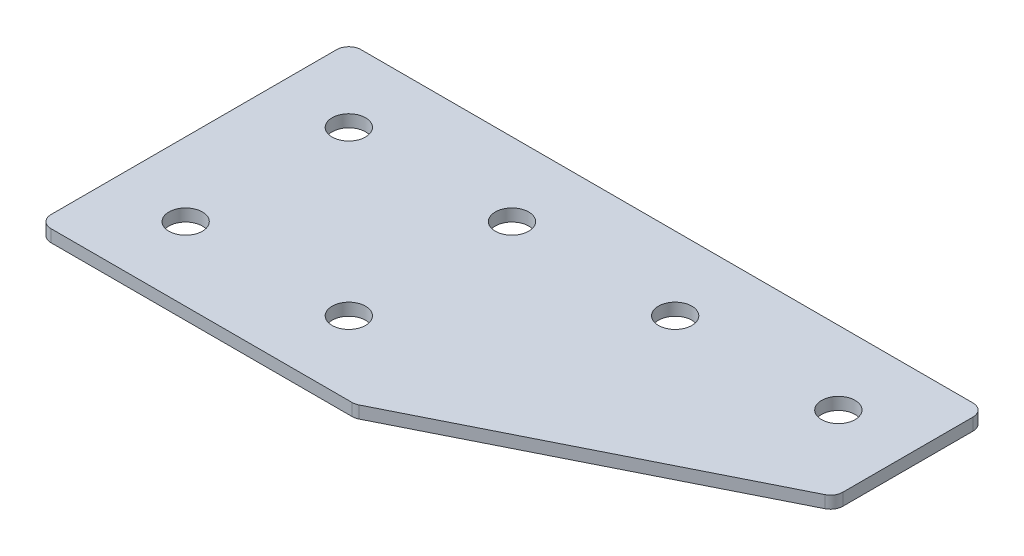
ISO-10303-21;
HEADER;
FILE_DESCRIPTION(('STEP AP214'),'2;1');
FILE_NAME('part.step','',(''),(''),'','','');
FILE_SCHEMA(('AUTOMOTIVE_DESIGN { 1 0 10303 214 1 1 1 1 }'));
ENDSEC;
DATA;
#1=APPLICATION_CONTEXT('core data for automotive mechanical design processes');
#2=APPLICATION_PROTOCOL_DEFINITION('international standard','automotive_design',2000,#1);
#3=PRODUCT_CONTEXT('',#1,'mechanical');
#4=PRODUCT('Part','Part','',(#3));
#5=PRODUCT_RELATED_PRODUCT_CATEGORY('part','',(#4));
#6=PRODUCT_DEFINITION_FORMATION('','',#4);
#7=PRODUCT_DEFINITION_CONTEXT('part definition',#1,'design');
#8=PRODUCT_DEFINITION('design','',#6,#7);
#9=PRODUCT_DEFINITION_SHAPE('','',#8);
#10=(LENGTH_UNIT() NAMED_UNIT(*) SI_UNIT(.MILLI.,.METRE.));
#11=(NAMED_UNIT(*) PLANE_ANGLE_UNIT() SI_UNIT($,.RADIAN.));
#12=(NAMED_UNIT(*) SI_UNIT($,.STERADIAN.) SOLID_ANGLE_UNIT());
#13=UNCERTAINTY_MEASURE_WITH_UNIT(LENGTH_MEASURE(1.E-05),#10,'distance_accuracy_value','');
#14=(GEOMETRIC_REPRESENTATION_CONTEXT(3) GLOBAL_UNCERTAINTY_ASSIGNED_CONTEXT((#13)) GLOBAL_UNIT_ASSIGNED_CONTEXT((#10,
#11,#12)) REPRESENTATION_CONTEXT('',''));
#15=CARTESIAN_POINT('',(0.,0.,0.));
#16=DIRECTION('',(0.,0.,1.));
#17=DIRECTION('',(1.,0.,0.));
#18=AXIS2_PLACEMENT_3D('',#15,#16,#17);
#19=CARTESIAN_POINT('',(-41.6411174198651,1.20798729371791,-21.0664297859648));
#20=DIRECTION('',(0.,-1.,0.));
#21=DIRECTION('',(0.,0.,-1.));
#22=AXIS2_PLACEMENT_3D('',#19,#20,#21);
#23=PLANE('',#22);
#24=CARTESIAN_POINT('',(-21.641117419865,1.20798729371791,18.9335702140352));
#25=DIRECTION('',(0.,1.,0.));
#26=DIRECTION('',(0.,0.,1.));
#27=AXIS2_PLACEMENT_3D('',#24,#25,#26);
#28=CIRCLE('',#27,4.1);
#29=CARTESIAN_POINT('',(-21.641117419865,1.20798729371791,23.0335702140352));
#30=VERTEX_POINT('',#29);
#31=EDGE_CURVE('E251',#30,#30,#28,.T.);
#32=ORIENTED_EDGE('',*,*,#31,.T.);
#33=EDGE_LOOP('',(#32));
#34=FACE_BOUND('',#33,.T.);
#35=CARTESIAN_POINT('',(-61.6411174198651,1.20798729371791,18.9335702140352));
#36=DIRECTION('',(0.,1.,0.));
#37=DIRECTION('',(0.,0.,1.));
#38=AXIS2_PLACEMENT_3D('',#35,#36,#37);
#39=CIRCLE('',#38,4.1);
#40=CARTESIAN_POINT('',(-61.6411174198651,1.20798729371791,23.0335702140352));
#41=VERTEX_POINT('',#40);
#42=EDGE_CURVE('E259',#41,#41,#39,.T.);
#43=ORIENTED_EDGE('',*,*,#42,.T.);
#44=EDGE_LOOP('',(#43));
#45=FACE_BOUND('',#44,.T.);
#46=CARTESIAN_POINT('',(58.358882580135,1.20798729371791,-21.0664297859648));
#47=DIRECTION('',(0.,1.,0.));
#48=DIRECTION('',(0.,0.,1.));
#49=AXIS2_PLACEMENT_3D('',#46,#47,#48);
#50=CIRCLE('',#49,4.09999999999999);
#51=CARTESIAN_POINT('',(58.358882580135,1.20798729371791,-16.9664297859648));
#52=VERTEX_POINT('',#51);
#53=EDGE_CURVE('E265',#52,#52,#50,.T.);
#54=ORIENTED_EDGE('',*,*,#53,.T.);
#55=EDGE_LOOP('',(#54));
#56=FACE_BOUND('',#55,.T.);
#57=CARTESIAN_POINT('',(18.358882580135,1.20798729371791,-21.0664297859648));
#58=DIRECTION('',(0.,1.,0.));
#59=DIRECTION('',(0.,0.,1.));
#60=AXIS2_PLACEMENT_3D('',#57,#58,#59);
#61=CIRCLE('',#60,4.09999999999999);
#62=CARTESIAN_POINT('',(18.358882580135,1.20798729371791,-16.9664297859648));
#63=VERTEX_POINT('',#62);
#64=EDGE_CURVE('E271',#63,#63,#61,.T.);
#65=ORIENTED_EDGE('',*,*,#64,.T.);
#66=EDGE_LOOP('',(#65));
#67=FACE_BOUND('',#66,.T.);
#68=CARTESIAN_POINT('',(-21.641117419865,1.20798729371791,-21.0664297859648));
#69=DIRECTION('',(0.,1.,0.));
#70=DIRECTION('',(0.,0.,1.));
#71=AXIS2_PLACEMENT_3D('',#68,#69,#70);
#72=CIRCLE('',#71,4.1);
#73=CARTESIAN_POINT('',(-21.641117419865,1.20798729371791,-16.9664297859648));
#74=VERTEX_POINT('',#73);
#75=EDGE_CURVE('E277',#74,#74,#72,.T.);
#76=ORIENTED_EDGE('',*,*,#75,.T.);
#77=EDGE_LOOP('',(#76));
#78=FACE_BOUND('',#77,.T.);
#79=CARTESIAN_POINT('',(-61.6411174198651,1.20798729371791,-21.0664297859648));
#80=DIRECTION('',(0.,1.,0.));
#81=DIRECTION('',(0.,0.,1.));
#82=AXIS2_PLACEMENT_3D('',#79,#80,#81);
#83=CIRCLE('',#82,4.1);
#84=CARTESIAN_POINT('',(-61.6411174198651,1.20798729371791,-16.9664297859648));
#85=VERTEX_POINT('',#84);
#86=EDGE_CURVE('E175',#85,#85,#83,.T.);
#87=ORIENTED_EDGE('',*,*,#86,.T.);
#88=EDGE_LOOP('',(#87));
#89=FACE_BOUND('',#88,.T.);
#90=DIRECTION('',(1.,0.,0.));
#91=VECTOR('',#90,1.);
#92=CARTESIAN_POINT('',(-79.6411174198652,1.20798729371791,36.9335702140352));
#93=LINE('',#92,#91);
#94=CARTESIAN_POINT('',(-76.6411174198652,1.20798729371791,36.9335702140352));
#95=VERTEX_POINT('',#94);
#96=CARTESIAN_POINT('',(-2.8214573073639,1.20798729371791,36.9335702140352));
#97=VERTEX_POINT('',#96);
#98=EDGE_CURVE('E121',#95,#97,#93,.T.);
#99=ORIENTED_EDGE('',*,*,#98,.F.);
#100=CARTESIAN_POINT('',(-76.6411174198652,1.20798729371791,33.9335702140352));
#101=DIRECTION('',(0.,-1.,0.));
#102=DIRECTION('',(0.,0.,-1.));
#103=AXIS2_PLACEMENT_3D('',#100,#101,#102);
#104=CIRCLE('',#103,3.);
#105=CARTESIAN_POINT('',(-79.6411174198652,1.20798729371791,33.9335702140352));
#106=VERTEX_POINT('',#105);
#107=EDGE_CURVE('E145',#95,#106,#104,.T.);
#108=ORIENTED_EDGE('',*,*,#107,.T.);
#109=DIRECTION('',(0.,0.,1.));
#110=VECTOR('',#109,1.);
#111=CARTESIAN_POINT('',(-79.6411174198652,1.20798729371791,-39.0664297859648));
#112=LINE('',#111,#110);
#113=CARTESIAN_POINT('',(-79.6411174198652,1.20798729371791,-36.0664297859648));
#114=VERTEX_POINT('',#113);
#115=EDGE_CURVE('E162',#114,#106,#112,.T.);
#116=ORIENTED_EDGE('',*,*,#115,.F.);
#117=CARTESIAN_POINT('',(-76.6411174198652,1.20798729371791,-36.0664297859648));
#118=DIRECTION('',(0.,-1.,0.));
#119=DIRECTION('',(0.,0.,-1.));
#120=AXIS2_PLACEMENT_3D('',#117,#118,#119);
#121=CIRCLE('',#120,3.);
#122=CARTESIAN_POINT('',(-76.6411174198652,1.20798729371791,-39.0664297859648));
#123=VERTEX_POINT('',#122);
#124=EDGE_CURVE('E117',#114,#123,#121,.T.);
#125=ORIENTED_EDGE('',*,*,#124,.T.);
#126=DIRECTION('',(-1.,0.,0.));
#127=VECTOR('',#126,1.);
#128=CARTESIAN_POINT('',(76.3588825801348,1.20798729371791,-39.0664297859648));
#129=LINE('',#128,#127);
#130=CARTESIAN_POINT('',(73.3588825801348,1.20798729371791,-39.0664297859648));
#131=VERTEX_POINT('',#130);
#132=EDGE_CURVE('E160',#131,#123,#129,.T.);
#133=ORIENTED_EDGE('',*,*,#132,.F.);
#134=CARTESIAN_POINT('',(73.3588825801348,1.20798729371791,-36.0664297859648));
#135=DIRECTION('',(0.,-1.,0.));
#136=DIRECTION('',(0.,0.,-1.));
#137=AXIS2_PLACEMENT_3D('',#134,#135,#136);
#138=CIRCLE('',#137,3.);
#139=CARTESIAN_POINT('',(76.3588825801348,1.20798729371791,-36.0664297859648));
#140=VERTEX_POINT('',#139);
#141=EDGE_CURVE('E140',#131,#140,#138,.T.);
#142=ORIENTED_EDGE('',*,*,#141,.T.);
#143=DIRECTION('',(0.,0.,-1.));
#144=VECTOR('',#143,1.);
#145=CARTESIAN_POINT('',(76.3588825801348,1.20798729371791,-2.3024977634646));
#146=LINE('',#145,#144);
#147=CARTESIAN_POINT('',(76.3588825801348,1.20798729371791,-4.15659972971429));
#148=VERTEX_POINT('',#147);
#149=EDGE_CURVE('E163',#148,#140,#146,.T.);
#150=ORIENTED_EDGE('',*,*,#149,.F.);
#151=CARTESIAN_POINT('',(73.3588825801348,1.20798729371791,-4.15659972971429));
#152=DIRECTION('',(0.,-1.,0.));
#153=DIRECTION('',(0.,0.,-1.));
#154=AXIS2_PLACEMENT_3D('',#151,#152,#153);
#155=CIRCLE('',#154,3.);
#156=CARTESIAN_POINT('',(74.7005233666347,1.20798729371791,-1.47331815671452));
#157=VERTEX_POINT('',#156);
#158=EDGE_CURVE('E31',#148,#157,#155,.T.);
#159=ORIENTED_EDGE('',*,*,#158,.T.);
#160=DIRECTION('',(0.894427190999915,0.,-0.447213595499959));
#161=VECTOR('',#160,1.);
#162=CARTESIAN_POINT('',(-2.11325337486452,1.20798729371791,36.9335702140352));
#163=LINE('',#162,#161);
#164=CARTESIAN_POINT('',(-1.47981652086402,1.20798729371791,36.6168517870349));
#165=VERTEX_POINT('',#164);
#166=EDGE_CURVE('E118',#165,#157,#163,.T.);
#167=ORIENTED_EDGE('',*,*,#166,.F.);
#168=CARTESIAN_POINT('',(-2.8214573073639,1.20798729371791,33.9335702140352));
#169=DIRECTION('',(0.,-1.,0.));
#170=DIRECTION('',(0.,0.,-1.));
#171=AXIS2_PLACEMENT_3D('',#168,#169,#170);
#172=CIRCLE('',#171,3.);
#173=EDGE_CURVE('E143',#165,#97,#172,.T.);
#174=ORIENTED_EDGE('',*,*,#173,.T.);
#175=EDGE_LOOP('',(#99,#108,#116,#125,#133,#142,#150,#159,#167,#174));
#176=FACE_BOUND('',#175,.T.);
#177=ADVANCED_FACE('F16',(#34,#45,#56,#67,#78,#89,#176),#23,.T.);
#178=CARTESIAN_POINT('',(76.3588825801348,1.20798729371791,-2.3024977634646));
#179=DIRECTION('',(1.,0.,0.));
#180=DIRECTION('',(0.,0.,-1.));
#181=AXIS2_PLACEMENT_3D('',#178,#179,#180);
#182=PLANE('',#181);
#183=DIRECTION('',(0.,0.,-1.));
#184=VECTOR('',#183,1.);
#185=CARTESIAN_POINT('',(76.3588825801348,4.20798729371791,-2.3024977634646));
#186=LINE('',#185,#184);
#187=CARTESIAN_POINT('',(76.3588825801348,4.20798729371791,-4.15659972971429));
#188=VERTEX_POINT('',#187);
#189=CARTESIAN_POINT('',(76.3588825801348,4.20798729371791,-36.0664297859648));
#190=VERTEX_POINT('',#189);
#191=EDGE_CURVE('E172',#188,#190,#186,.T.);
#192=ORIENTED_EDGE('',*,*,#191,.F.);
#193=DIRECTION('',(0.,1.,0.));
#194=VECTOR('',#193,1.);
#195=CARTESIAN_POINT('',(76.3588825801348,1.20798729371791,-4.15659972971429));
#196=LINE('',#195,#194);
#197=EDGE_CURVE('E154',#188,#148,#196,.F.);
#198=ORIENTED_EDGE('',*,*,#197,.T.);
#199=ORIENTED_EDGE('',*,*,#149,.T.);
#200=DIRECTION('',(0.,1.,0.));
#201=VECTOR('',#200,1.);
#202=CARTESIAN_POINT('',(76.3588825801348,1.20798729371791,-36.0664297859648));
#203=LINE('',#202,#201);
#204=EDGE_CURVE('E151',#140,#190,#203,.T.);
#205=ORIENTED_EDGE('',*,*,#204,.T.);
#206=EDGE_LOOP('',(#192,#198,#199,#205));
#207=FACE_BOUND('',#206,.T.);
#208=ADVANCED_FACE('F206',(#207),#182,.T.);
#209=CARTESIAN_POINT('',(-2.11325337486452,1.20798729371791,36.9335702140352));
#210=DIRECTION('',(0.447213595499959,0.,0.894427190999916));
#211=DIRECTION('',(0.894427190999916,0.,-0.447213595499959));
#212=AXIS2_PLACEMENT_3D('',#209,#210,#211);
#213=PLANE('',#212);
#214=DIRECTION('',(0.894427190999915,0.,-0.447213595499959));
#215=VECTOR('',#214,1.);
#216=CARTESIAN_POINT('',(-2.11325337486452,4.20798729371791,36.9335702140352));
#217=LINE('',#216,#215);
#218=CARTESIAN_POINT('',(-1.47981652086402,4.20798729371791,36.6168517870349));
#219=VERTEX_POINT('',#218);
#220=CARTESIAN_POINT('',(74.7005233666347,4.20798729371791,-1.47331815671452));
#221=VERTEX_POINT('',#220);
#222=EDGE_CURVE('E124',#219,#221,#217,.T.);
#223=ORIENTED_EDGE('',*,*,#222,.F.);
#224=DIRECTION('',(0.,1.,0.));
#225=VECTOR('',#224,1.);
#226=CARTESIAN_POINT('',(-1.47981652086402,1.20798729371791,36.6168517870349));
#227=LINE('',#226,#225);
#228=EDGE_CURVE('E38',#219,#165,#227,.F.);
#229=ORIENTED_EDGE('',*,*,#228,.T.);
#230=ORIENTED_EDGE('',*,*,#166,.T.);
#231=DIRECTION('',(0.,1.,0.));
#232=VECTOR('',#231,1.);
#233=CARTESIAN_POINT('',(74.7005233666347,1.20798729371791,-1.47331815671455));
#234=LINE('',#233,#232);
#235=EDGE_CURVE('E147',#157,#221,#234,.T.);
#236=ORIENTED_EDGE('',*,*,#235,.T.);
#237=EDGE_LOOP('',(#223,#229,#230,#236));
#238=FACE_BOUND('',#237,.T.);
#239=ADVANCED_FACE('F180',(#238),#213,.T.);
#240=CARTESIAN_POINT('',(-79.6411174198652,1.20798729371791,36.9335702140352));
#241=DIRECTION('',(0.,0.,1.));
#242=DIRECTION('',(1.,0.,0.));
#243=AXIS2_PLACEMENT_3D('',#240,#241,#242);
#244=PLANE('',#243);
#245=DIRECTION('',(1.,0.,0.));
#246=VECTOR('',#245,1.);
#247=CARTESIAN_POINT('',(-79.6411174198652,4.20798729371791,36.9335702140352));
#248=LINE('',#247,#246);
#249=CARTESIAN_POINT('',(-76.6411174198652,4.20798729371791,36.9335702140352));
#250=VERTEX_POINT('',#249);
#251=CARTESIAN_POINT('',(-2.8214573073639,4.20798729371791,36.9335702140352));
#252=VERTEX_POINT('',#251);
#253=EDGE_CURVE('E114',#250,#252,#248,.T.);
#254=ORIENTED_EDGE('',*,*,#253,.F.);
#255=DIRECTION('',(0.,1.,0.));
#256=VECTOR('',#255,1.);
#257=CARTESIAN_POINT('',(-76.6411174198652,1.20798729371791,36.9335702140352));
#258=LINE('',#257,#256);
#259=EDGE_CURVE('E137',#250,#95,#258,.F.);
#260=ORIENTED_EDGE('',*,*,#259,.T.);
#261=ORIENTED_EDGE('',*,*,#98,.T.);
#262=DIRECTION('',(0.,1.,0.));
#263=VECTOR('',#262,1.);
#264=CARTESIAN_POINT('',(-2.8214573073639,1.20798729371791,36.9335702140352));
#265=LINE('',#264,#263);
#266=EDGE_CURVE('E134',#97,#252,#265,.T.);
#267=ORIENTED_EDGE('',*,*,#266,.T.);
#268=EDGE_LOOP('',(#254,#260,#261,#267));
#269=FACE_BOUND('',#268,.T.);
#270=ADVANCED_FACE('F189',(#269),#244,.T.);
#271=CARTESIAN_POINT('',(-79.6411174198652,1.20798729371791,-39.0664297859648));
#272=DIRECTION('',(-1.,0.,0.));
#273=DIRECTION('',(0.,0.,1.));
#274=AXIS2_PLACEMENT_3D('',#271,#272,#273);
#275=PLANE('',#274);
#276=ORIENTED_EDGE('',*,*,#115,.T.);
#277=DIRECTION('',(0.,1.,0.));
#278=VECTOR('',#277,1.);
#279=CARTESIAN_POINT('',(-79.6411174198652,1.20798729371791,33.9335702140352));
#280=LINE('',#279,#278);
#281=CARTESIAN_POINT('',(-79.6411174198652,4.20798729371791,33.9335702140352));
#282=VERTEX_POINT('',#281);
#283=EDGE_CURVE('E105',#106,#282,#280,.T.);
#284=ORIENTED_EDGE('',*,*,#283,.T.);
#285=DIRECTION('',(0.,0.,1.));
#286=VECTOR('',#285,1.);
#287=CARTESIAN_POINT('',(-79.6411174198652,4.20798729371791,-39.0664297859648));
#288=LINE('',#287,#286);
#289=CARTESIAN_POINT('',(-79.6411174198652,4.20798729371791,-36.0664297859648));
#290=VERTEX_POINT('',#289);
#291=EDGE_CURVE('E97',#290,#282,#288,.T.);
#292=ORIENTED_EDGE('',*,*,#291,.F.);
#293=DIRECTION('',(0.,1.,0.));
#294=VECTOR('',#293,1.);
#295=CARTESIAN_POINT('',(-79.6411174198652,1.20798729371791,-36.0664297859648));
#296=LINE('',#295,#294);
#297=EDGE_CURVE('E111',#290,#114,#296,.F.);
#298=ORIENTED_EDGE('',*,*,#297,.T.);
#299=EDGE_LOOP('',(#276,#284,#292,#298));
#300=FACE_BOUND('',#299,.T.);
#301=ADVANCED_FACE('F110',(#300),#275,.T.);
#302=CARTESIAN_POINT('',(76.3588825801348,1.20798729371791,-39.0664297859648));
#303=DIRECTION('',(0.,0.,-1.));
#304=DIRECTION('',(-1.,0.,0.));
#305=AXIS2_PLACEMENT_3D('',#302,#303,#304);
#306=PLANE('',#305);
#307=DIRECTION('',(-1.,0.,0.));
#308=VECTOR('',#307,1.);
#309=CARTESIAN_POINT('',(76.3588825801348,4.20798729371791,-39.0664297859648));
#310=LINE('',#309,#308);
#311=CARTESIAN_POINT('',(73.3588825801348,4.20798729371791,-39.0664297859648));
#312=VERTEX_POINT('',#311);
#313=CARTESIAN_POINT('',(-76.6411174198652,4.20798729371791,-39.0664297859648));
#314=VERTEX_POINT('',#313);
#315=EDGE_CURVE('E99',#312,#314,#310,.T.);
#316=ORIENTED_EDGE('',*,*,#315,.F.);
#317=DIRECTION('',(0.,1.,0.));
#318=VECTOR('',#317,1.);
#319=CARTESIAN_POINT('',(73.3588825801348,1.20798729371791,-39.0664297859648));
#320=LINE('',#319,#318);
#321=EDGE_CURVE('E10',#312,#131,#320,.F.);
#322=ORIENTED_EDGE('',*,*,#321,.T.);
#323=ORIENTED_EDGE('',*,*,#132,.T.);
#324=DIRECTION('',(0.,1.,0.));
#325=VECTOR('',#324,1.);
#326=CARTESIAN_POINT('',(-76.6411174198652,1.20798729371791,-39.0664297859648));
#327=LINE('',#326,#325);
#328=EDGE_CURVE('E24',#123,#314,#327,.T.);
#329=ORIENTED_EDGE('',*,*,#328,.T.);
#330=EDGE_LOOP('',(#316,#322,#323,#329));
#331=FACE_BOUND('',#330,.T.);
#332=ADVANCED_FACE('F157',(#331),#306,.T.);
#333=CARTESIAN_POINT('',(-41.6411174198651,4.20798729371791,-21.0664297859648));
#334=DIRECTION('',(0.,-1.,0.));
#335=DIRECTION('',(0.,0.,-1.));
#336=AXIS2_PLACEMENT_3D('',#333,#334,#335);
#337=PLANE('',#336);
#338=CARTESIAN_POINT('',(-21.641117419865,4.20798729371791,18.9335702140352));
#339=DIRECTION('',(0.,1.,0.));
#340=DIRECTION('',(0.,0.,1.));
#341=AXIS2_PLACEMENT_3D('',#338,#339,#340);
#342=CIRCLE('',#341,4.1);
#343=CARTESIAN_POINT('',(-21.641117419865,4.20798729371791,23.0335702140352));
#344=VERTEX_POINT('',#343);
#345=EDGE_CURVE('E254',#344,#344,#342,.T.);
#346=ORIENTED_EDGE('',*,*,#345,.F.);
#347=EDGE_LOOP('',(#346));
#348=FACE_BOUND('',#347,.T.);
#349=CARTESIAN_POINT('',(-61.6411174198651,4.20798729371791,18.9335702140352));
#350=DIRECTION('',(0.,1.,0.));
#351=DIRECTION('',(0.,0.,1.));
#352=AXIS2_PLACEMENT_3D('',#349,#350,#351);
#353=CIRCLE('',#352,4.1);
#354=CARTESIAN_POINT('',(-61.6411174198651,4.20798729371791,23.0335702140352));
#355=VERTEX_POINT('',#354);
#356=EDGE_CURVE('E256',#355,#355,#353,.T.);
#357=ORIENTED_EDGE('',*,*,#356,.F.);
#358=EDGE_LOOP('',(#357));
#359=FACE_BOUND('',#358,.T.);
#360=CARTESIAN_POINT('',(58.358882580135,4.20798729371791,-21.0664297859648));
#361=DIRECTION('',(0.,1.,0.));
#362=DIRECTION('',(0.,0.,1.));
#363=AXIS2_PLACEMENT_3D('',#360,#361,#362);
#364=CIRCLE('',#363,4.09999999999999);
#365=CARTESIAN_POINT('',(58.358882580135,4.20798729371791,-16.9664297859648));
#366=VERTEX_POINT('',#365);
#367=EDGE_CURVE('E262',#366,#366,#364,.T.);
#368=ORIENTED_EDGE('',*,*,#367,.F.);
#369=EDGE_LOOP('',(#368));
#370=FACE_BOUND('',#369,.T.);
#371=CARTESIAN_POINT('',(18.358882580135,4.20798729371791,-21.0664297859648));
#372=DIRECTION('',(0.,1.,0.));
#373=DIRECTION('',(0.,0.,1.));
#374=AXIS2_PLACEMENT_3D('',#371,#372,#373);
#375=CIRCLE('',#374,4.09999999999999);
#376=CARTESIAN_POINT('',(18.358882580135,4.20798729371791,-16.9664297859648));
#377=VERTEX_POINT('',#376);
#378=EDGE_CURVE('E268',#377,#377,#375,.T.);
#379=ORIENTED_EDGE('',*,*,#378,.F.);
#380=EDGE_LOOP('',(#379));
#381=FACE_BOUND('',#380,.T.);
#382=CARTESIAN_POINT('',(-21.641117419865,4.20798729371791,-21.0664297859648));
#383=DIRECTION('',(0.,1.,0.));
#384=DIRECTION('',(0.,0.,1.));
#385=AXIS2_PLACEMENT_3D('',#382,#383,#384);
#386=CIRCLE('',#385,4.1);
#387=CARTESIAN_POINT('',(-21.641117419865,4.20798729371791,-16.9664297859648));
#388=VERTEX_POINT('',#387);
#389=EDGE_CURVE('E274',#388,#388,#386,.T.);
#390=ORIENTED_EDGE('',*,*,#389,.F.);
#391=EDGE_LOOP('',(#390));
#392=FACE_BOUND('',#391,.T.);
#393=CARTESIAN_POINT('',(-61.6411174198651,4.20798729371791,-21.0664297859648));
#394=DIRECTION('',(0.,1.,0.));
#395=DIRECTION('',(0.,0.,1.));
#396=AXIS2_PLACEMENT_3D('',#393,#394,#395);
#397=CIRCLE('',#396,4.1);
#398=CARTESIAN_POINT('',(-61.6411174198651,4.20798729371791,-16.9664297859648));
#399=VERTEX_POINT('',#398);
#400=EDGE_CURVE('E280',#399,#399,#397,.T.);
#401=ORIENTED_EDGE('',*,*,#400,.F.);
#402=EDGE_LOOP('',(#401));
#403=FACE_BOUND('',#402,.T.);
#404=ORIENTED_EDGE('',*,*,#291,.T.);
#405=CARTESIAN_POINT('',(-76.6411174198652,4.20798729371791,33.9335702140352));
#406=DIRECTION('',(0.,-1.,0.));
#407=DIRECTION('',(0.,0.,-1.));
#408=AXIS2_PLACEMENT_3D('',#405,#406,#407);
#409=CIRCLE('',#408,3.);
#410=EDGE_CURVE('E132',#282,#250,#409,.F.);
#411=ORIENTED_EDGE('',*,*,#410,.T.);
#412=ORIENTED_EDGE('',*,*,#253,.T.);
#413=CARTESIAN_POINT('',(-2.8214573073639,4.20798729371791,33.9335702140352));
#414=DIRECTION('',(0.,-1.,0.));
#415=DIRECTION('',(0.,0.,-1.));
#416=AXIS2_PLACEMENT_3D('',#413,#414,#415);
#417=CIRCLE('',#416,3.);
#418=EDGE_CURVE('E130',#252,#219,#417,.F.);
#419=ORIENTED_EDGE('',*,*,#418,.T.);
#420=ORIENTED_EDGE('',*,*,#222,.T.);
#421=CARTESIAN_POINT('',(73.3588825801348,4.20798729371791,-4.15659972971429));
#422=DIRECTION('',(0.,-1.,0.));
#423=DIRECTION('',(0.,0.,-1.));
#424=AXIS2_PLACEMENT_3D('',#421,#422,#423);
#425=CIRCLE('',#424,3.);
#426=EDGE_CURVE('E128',#221,#188,#425,.F.);
#427=ORIENTED_EDGE('',*,*,#426,.T.);
#428=ORIENTED_EDGE('',*,*,#191,.T.);
#429=CARTESIAN_POINT('',(73.3588825801348,4.20798729371791,-36.0664297859648));
#430=DIRECTION('',(0.,-1.,0.));
#431=DIRECTION('',(0.,0.,-1.));
#432=AXIS2_PLACEMENT_3D('',#429,#430,#431);
#433=CIRCLE('',#432,3.);
#434=EDGE_CURVE('E104',#190,#312,#433,.F.);
#435=ORIENTED_EDGE('',*,*,#434,.T.);
#436=ORIENTED_EDGE('',*,*,#315,.T.);
#437=CARTESIAN_POINT('',(-76.6411174198652,4.20798729371791,-36.0664297859648));
#438=DIRECTION('',(0.,-1.,0.));
#439=DIRECTION('',(0.,0.,-1.));
#440=AXIS2_PLACEMENT_3D('',#437,#438,#439);
#441=CIRCLE('',#440,3.);
#442=EDGE_CURVE('E94',#314,#290,#441,.F.);
#443=ORIENTED_EDGE('',*,*,#442,.T.);
#444=EDGE_LOOP('',(#404,#411,#412,#419,#420,#427,#428,#435,#436,#443));
#445=FACE_BOUND('',#444,.T.);
#446=ADVANCED_FACE('F96',(#348,#359,#370,#381,#392,#403,#445),#337,.F.);
#447=CARTESIAN_POINT('',(-76.6411174198652,1.20798729371791,33.9335702140352));
#448=DIRECTION('',(0.,1.,0.));
#449=DIRECTION('',(0.,0.,1.));
#450=AXIS2_PLACEMENT_3D('',#447,#448,#449);
#451=CYLINDRICAL_SURFACE('',#450,3.);
#452=ORIENTED_EDGE('',*,*,#107,.F.);
#453=ORIENTED_EDGE('',*,*,#259,.F.);
#454=ORIENTED_EDGE('',*,*,#410,.F.);
#455=ORIENTED_EDGE('',*,*,#283,.F.);
#456=EDGE_LOOP('',(#452,#453,#454,#455));
#457=FACE_BOUND('',#456,.T.);
#458=ADVANCED_FACE('F192',(#457),#451,.T.);
#459=CARTESIAN_POINT('',(-2.8214573073639,1.20798729371791,33.9335702140352));
#460=DIRECTION('',(0.,1.,0.));
#461=DIRECTION('',(0.,0.,1.));
#462=AXIS2_PLACEMENT_3D('',#459,#460,#461);
#463=CYLINDRICAL_SURFACE('',#462,3.);
#464=ORIENTED_EDGE('',*,*,#173,.F.);
#465=ORIENTED_EDGE('',*,*,#228,.F.);
#466=ORIENTED_EDGE('',*,*,#418,.F.);
#467=ORIENTED_EDGE('',*,*,#266,.F.);
#468=EDGE_LOOP('',(#464,#465,#466,#467));
#469=FACE_BOUND('',#468,.T.);
#470=ADVANCED_FACE('F184',(#469),#463,.T.);
#471=CARTESIAN_POINT('',(73.3588825801348,1.20798729371791,-4.15659972971429));
#472=DIRECTION('',(0.,1.,0.));
#473=DIRECTION('',(0.,0.,1.));
#474=AXIS2_PLACEMENT_3D('',#471,#472,#473);
#475=CYLINDRICAL_SURFACE('',#474,3.);
#476=ORIENTED_EDGE('',*,*,#158,.F.);
#477=ORIENTED_EDGE('',*,*,#197,.F.);
#478=ORIENTED_EDGE('',*,*,#426,.F.);
#479=ORIENTED_EDGE('',*,*,#235,.F.);
#480=EDGE_LOOP('',(#476,#477,#478,#479));
#481=FACE_BOUND('',#480,.T.);
#482=ADVANCED_FACE('F200',(#481),#475,.T.);
#483=CARTESIAN_POINT('',(73.3588825801348,1.20798729371791,-36.0664297859648));
#484=DIRECTION('',(0.,1.,0.));
#485=DIRECTION('',(0.,0.,1.));
#486=AXIS2_PLACEMENT_3D('',#483,#484,#485);
#487=CYLINDRICAL_SURFACE('',#486,3.);
#488=ORIENTED_EDGE('',*,*,#141,.F.);
#489=ORIENTED_EDGE('',*,*,#321,.F.);
#490=ORIENTED_EDGE('',*,*,#434,.F.);
#491=ORIENTED_EDGE('',*,*,#204,.F.);
#492=EDGE_LOOP('',(#488,#489,#490,#491));
#493=FACE_BOUND('',#492,.T.);
#494=ADVANCED_FACE('F337',(#493),#487,.T.);
#495=CARTESIAN_POINT('',(-76.6411174198652,1.20798729371791,-36.0664297859648));
#496=DIRECTION('',(0.,1.,0.));
#497=DIRECTION('',(0.,0.,1.));
#498=AXIS2_PLACEMENT_3D('',#495,#496,#497);
#499=CYLINDRICAL_SURFACE('',#498,3.);
#500=ORIENTED_EDGE('',*,*,#124,.F.);
#501=ORIENTED_EDGE('',*,*,#297,.F.);
#502=ORIENTED_EDGE('',*,*,#442,.F.);
#503=ORIENTED_EDGE('',*,*,#328,.F.);
#504=EDGE_LOOP('',(#500,#501,#502,#503));
#505=FACE_BOUND('',#504,.T.);
#506=ADVANCED_FACE('F18',(#505),#499,.T.);
#507=CARTESIAN_POINT('',(-61.6411174198651,1.20798729371791,-21.0664297859648));
#508=DIRECTION('',(0.,1.,0.));
#509=DIRECTION('',(0.,0.,1.));
#510=AXIS2_PLACEMENT_3D('',#507,#508,#509);
#511=CYLINDRICAL_SURFACE('',#510,4.1);
#512=ORIENTED_EDGE('',*,*,#86,.F.);
#513=EDGE_LOOP('',(#512));
#514=FACE_BOUND('',#513,.T.);
#515=ORIENTED_EDGE('',*,*,#400,.T.);
#516=EDGE_LOOP('',(#515));
#517=FACE_BOUND('',#516,.T.);
#518=ADVANCED_FACE('F224',(#514,#517),#511,.F.);
#519=CARTESIAN_POINT('',(-21.641117419865,1.20798729371791,-21.0664297859648));
#520=DIRECTION('',(0.,1.,0.));
#521=DIRECTION('',(0.,0.,1.));
#522=AXIS2_PLACEMENT_3D('',#519,#520,#521);
#523=CYLINDRICAL_SURFACE('',#522,4.1);
#524=ORIENTED_EDGE('',*,*,#75,.F.);
#525=EDGE_LOOP('',(#524));
#526=FACE_BOUND('',#525,.T.);
#527=ORIENTED_EDGE('',*,*,#389,.T.);
#528=EDGE_LOOP('',(#527));
#529=FACE_BOUND('',#528,.T.);
#530=ADVANCED_FACE('F227',(#526,#529),#523,.F.);
#531=CARTESIAN_POINT('',(18.358882580135,1.20798729371791,-21.0664297859648));
#532=DIRECTION('',(0.,1.,0.));
#533=DIRECTION('',(0.,0.,1.));
#534=AXIS2_PLACEMENT_3D('',#531,#532,#533);
#535=CYLINDRICAL_SURFACE('',#534,4.09999999999999);
#536=ORIENTED_EDGE('',*,*,#64,.F.);
#537=EDGE_LOOP('',(#536));
#538=FACE_BOUND('',#537,.T.);
#539=ORIENTED_EDGE('',*,*,#378,.T.);
#540=EDGE_LOOP('',(#539));
#541=FACE_BOUND('',#540,.T.);
#542=ADVANCED_FACE('F231',(#538,#541),#535,.F.);
#543=CARTESIAN_POINT('',(58.358882580135,1.20798729371791,-21.0664297859648));
#544=DIRECTION('',(0.,1.,0.));
#545=DIRECTION('',(0.,0.,1.));
#546=AXIS2_PLACEMENT_3D('',#543,#544,#545);
#547=CYLINDRICAL_SURFACE('',#546,4.09999999999999);
#548=ORIENTED_EDGE('',*,*,#53,.F.);
#549=EDGE_LOOP('',(#548));
#550=FACE_BOUND('',#549,.T.);
#551=ORIENTED_EDGE('',*,*,#367,.T.);
#552=EDGE_LOOP('',(#551));
#553=FACE_BOUND('',#552,.T.);
#554=ADVANCED_FACE('F235',(#550,#553),#547,.F.);
#555=CARTESIAN_POINT('',(-61.6411174198651,1.20798729371791,18.9335702140352));
#556=DIRECTION('',(0.,1.,0.));
#557=DIRECTION('',(0.,0.,1.));
#558=AXIS2_PLACEMENT_3D('',#555,#556,#557);
#559=CYLINDRICAL_SURFACE('',#558,4.1);
#560=ORIENTED_EDGE('',*,*,#42,.F.);
#561=EDGE_LOOP('',(#560));
#562=FACE_BOUND('',#561,.T.);
#563=ORIENTED_EDGE('',*,*,#356,.T.);
#564=EDGE_LOOP('',(#563));
#565=FACE_BOUND('',#564,.T.);
#566=ADVANCED_FACE('F239',(#562,#565),#559,.F.);
#567=CARTESIAN_POINT('',(-21.641117419865,1.20798729371791,18.9335702140352));
#568=DIRECTION('',(0.,1.,0.));
#569=DIRECTION('',(0.,0.,1.));
#570=AXIS2_PLACEMENT_3D('',#567,#568,#569);
#571=CYLINDRICAL_SURFACE('',#570,4.1);
#572=ORIENTED_EDGE('',*,*,#31,.F.);
#573=EDGE_LOOP('',(#572));
#574=FACE_BOUND('',#573,.T.);
#575=ORIENTED_EDGE('',*,*,#345,.T.);
#576=EDGE_LOOP('',(#575));
#577=FACE_BOUND('',#576,.T.);
#578=ADVANCED_FACE('F243',(#574,#577),#571,.F.);
#579=CLOSED_SHELL('',(#177,#208,#239,#270,#301,#332,#446,#458,#470,#482,#494,#506,#518,#530,
#542,#554,#566,#578));
#580=MANIFOLD_SOLID_BREP('B1',#579);
#581=ADVANCED_BREP_SHAPE_REPRESENTATION('',(#18,#580),#14);
#582=SHAPE_DEFINITION_REPRESENTATION(#9,#581);
ENDSEC;
END-ISO-10303-21;
